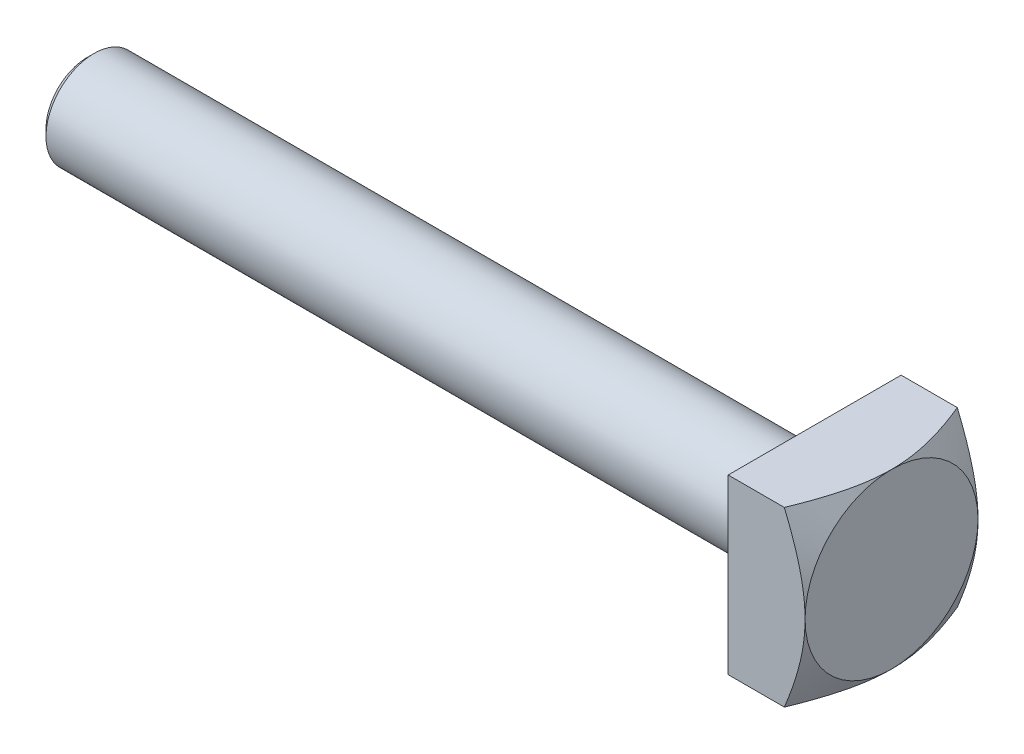
ISO-10303-21;
HEADER;
FILE_DESCRIPTION(('STEP AP214'),'2;1');
FILE_NAME('part.step','',(''),(''),'','','');
FILE_SCHEMA(('AUTOMOTIVE_DESIGN { 1 0 10303 214 1 1 1 1 }'));
ENDSEC;
DATA;
#1=APPLICATION_CONTEXT('core data for automotive mechanical design processes');
#2=APPLICATION_PROTOCOL_DEFINITION('international standard','automotive_design',2000,#1);
#3=PRODUCT_CONTEXT('',#1,'mechanical');
#4=PRODUCT('Part','Part','',(#3));
#5=PRODUCT_RELATED_PRODUCT_CATEGORY('part','',(#4));
#6=PRODUCT_DEFINITION_FORMATION('','',#4);
#7=PRODUCT_DEFINITION_CONTEXT('part definition',#1,'design');
#8=PRODUCT_DEFINITION('design','',#6,#7);
#9=PRODUCT_DEFINITION_SHAPE('','',#8);
#10=(LENGTH_UNIT() NAMED_UNIT(*) SI_UNIT(.MILLI.,.METRE.));
#11=(NAMED_UNIT(*) PLANE_ANGLE_UNIT() SI_UNIT($,.RADIAN.));
#12=(NAMED_UNIT(*) SI_UNIT($,.STERADIAN.) SOLID_ANGLE_UNIT());
#13=UNCERTAINTY_MEASURE_WITH_UNIT(LENGTH_MEASURE(1.E-05),#10,'distance_accuracy_value','');
#14=(GEOMETRIC_REPRESENTATION_CONTEXT(3) GLOBAL_UNCERTAINTY_ASSIGNED_CONTEXT((#13)) GLOBAL_UNIT_ASSIGNED_CONTEXT((#10,
#11,#12)) REPRESENTATION_CONTEXT('',''));
#15=CARTESIAN_POINT('',(0.,0.,0.));
#16=DIRECTION('',(0.,0.,1.));
#17=DIRECTION('',(1.,0.,0.));
#18=AXIS2_PLACEMENT_3D('',#15,#16,#17);
#19=CARTESIAN_POINT('',(49.3325100261348,9.,-9.));
#20=DIRECTION('',(0.,0.,1.));
#21=DIRECTION('',(0.,-1.,0.));
#22=AXIS2_PLACEMENT_3D('',#19,#20,#21);
#23=PLANE('',#22);
#24=CARTESIAN_POINT('',(42.8571264990048,-18.1017748932251,-9.));
#25=CARTESIAN_POINT('',(43.0848290014647,-17.6612589377098,-9.));
#26=CARTESIAN_POINT('',(43.3112860429918,-17.2200930246903,-9.));
#27=CARTESIAN_POINT('',(43.7610460759945,-16.3361243206803,-9.));
#28=CARTESIAN_POINT('',(43.9843488789998,-15.893321433856,-9.));
#29=CARTESIAN_POINT('',(44.4275990724742,-15.0048139056271,-9.));
#30=CARTESIAN_POINT('',(44.6475379613083,-14.5591050150091,-9.));
#31=CARTESIAN_POINT('',(45.0826038939738,-13.6653526957074,-9.));
#32=CARTESIAN_POINT('',(45.2977310422765,-13.2173093179705,-9.));
#33=CARTESIAN_POINT('',(45.7339460114688,-12.2929271397109,-9.));
#34=CARTESIAN_POINT('',(45.9546822234214,-11.8164219208137,-9.));
#35=CARTESIAN_POINT('',(46.3874426773042,-10.8594183684812,-9.));
#36=CARTESIAN_POINT('',(46.5994663826154,-10.3789197912727,-9.));
#37=CARTESIAN_POINT('',(47.0118693140859,-9.41339556488041,-9.));
#38=CARTESIAN_POINT('',(47.2122579538238,-8.92837395459212,-9.));
#39=CARTESIAN_POINT('',(47.5977586152819,-7.95230683121941,-9.));
#40=CARTESIAN_POINT('',(47.782872961797,-7.46126224796708,-9.));
#41=CARTESIAN_POINT('',(48.0440952998417,-6.72205623629925,-9.));
#42=CARTESIAN_POINT('',(48.1279877465829,-6.47664584233824,-9.));
#43=CARTESIAN_POINT('',(48.2899112549478,-5.98390233794157,-9.));
#44=CARTESIAN_POINT('',(48.3679423425386,-5.7365692360293,-9.));
#45=CARTESIAN_POINT('',(48.5919234373371,-4.99146980810668,-9.));
#46=CARTESIAN_POINT('',(48.7277667272913,-4.49058825682384,-9.));
#47=CARTESIAN_POINT('',(48.9615567599171,-3.49029425867013,-9.));
#48=CARTESIAN_POINT('',(49.0602031345005,-2.99105052515099,-9.));
#49=CARTESIAN_POINT('',(49.1761930199103,-2.23731632818205,-9.));
#50=CARTESIAN_POINT('',(49.2095268563288,-1.9852530110465,-9.));
#51=CARTESIAN_POINT('',(49.2646801673453,-1.47988072595095,-9.));
#52=CARTESIAN_POINT('',(49.2865008184612,-1.22657188794033,-9.));
#53=CARTESIAN_POINT('',(49.3215491863488,-0.661621376465719,-9.));
#54=CARTESIAN_POINT('',(49.3317045942102,-0.349782683998991,-9.));
#55=CARTESIAN_POINT('',(49.3332232252704,0.273946712163919,-9.));
#56=CARTESIAN_POINT('',(49.3245857611839,0.585837417345174,-9.));
#57=CARTESIAN_POINT('',(49.2889201862553,1.20861594829024,-9.));
#58=CARTESIAN_POINT('',(49.2618883258218,1.51950355659402,-9.));
#59=CARTESIAN_POINT('',(49.1906150441582,2.13928297825901,-9.));
#60=CARTESIAN_POINT('',(49.1463730476391,2.44817472455294,-9.));
#61=CARTESIAN_POINT('',(49.0409293862979,3.07199163964561,-9.));
#62=CARTESIAN_POINT('',(48.9792843562127,3.38684108287753,-9.));
#63=CARTESIAN_POINT('',(48.8417401677814,4.01338447228308,-9.));
#64=CARTESIAN_POINT('',(48.7658406400166,4.32507833645622,-9.));
#65=CARTESIAN_POINT('',(48.6018632193055,4.94539738591791,-9.));
#66=CARTESIAN_POINT('',(48.5137790599304,5.25402090404895,-9.));
#67=CARTESIAN_POINT('',(48.3740006498793,5.71459738376124,-9.));
#68=CARTESIAN_POINT('',(48.3261331737932,5.86772771850972,-9.));
#69=CARTESIAN_POINT('',(48.228060525201,6.17323857639417,-9.));
#70=CARTESIAN_POINT('',(48.1778553539461,6.32561909993144,-9.));
#71=CARTESIAN_POINT('',(48.0336207759508,6.75327955916404,-9.));
#72=CARTESIAN_POINT('',(47.9371522959459,7.02773820362801,-9.));
#73=CARTESIAN_POINT('',(47.7382764571364,7.5745024899511,-9.));
#74=CARTESIAN_POINT('',(47.635868739271,7.84680800050774,-9.));
#75=CARTESIAN_POINT('',(47.4259979322936,8.38952634357004,-9.));
#76=CARTESIAN_POINT('',(47.3185337697091,8.65993876005014,-9.));
#77=CARTESIAN_POINT('',(47.0993180334821,9.1990230644776,-9.));
#78=CARTESIAN_POINT('',(46.9875663470345,9.46769490641265,-9.));
#79=CARTESIAN_POINT('',(46.6466464450032,10.2718794378225,-9.));
#80=CARTESIAN_POINT('',(46.4120049359439,10.8050727688798,-9.));
#81=CARTESIAN_POINT('',(45.9320394137551,11.8665226777474,-9.));
#82=CARTESIAN_POINT('',(45.6867165417881,12.3947797756403,-9.));
#83=CARTESIAN_POINT('',(45.1872036037991,13.4491484430963,-9.));
#84=CARTESIAN_POINT('',(44.9329876443729,13.9752477145128,-9.));
#85=CARTESIAN_POINT('',(44.4183349749992,15.0244001691293,-9.));
#86=CARTESIAN_POINT('',(44.157898129916,15.5474532858505,-9.));
#87=CARTESIAN_POINT('',(43.6323200467052,16.5908336156542,-9.));
#88=CARTESIAN_POINT('',(43.3671814160637,17.1111621443734,-9.));
#89=CARTESIAN_POINT('',(42.8330653729605,18.149836976446,-9.));
#90=CARTESIAN_POINT('',(42.5640879911795,18.6681832956,-8.99999999999999));
#91=CARTESIAN_POINT('',(41.8255485481526,20.0811503383153,-8.99999999999999));
#92=CARTESIAN_POINT('',(41.3529251789218,20.9741702349986,-8.99999999999999));
#93=CARTESIAN_POINT('',(40.4011346006905,22.7568811836065,-8.99999999999999));
#94=CARTESIAN_POINT('',(39.9219664042756,23.6465717068492,-8.99999999999999));
#95=CARTESIAN_POINT('',(38.9620672069348,25.4174938178518,-8.99999999999999));
#96=CARTESIAN_POINT('',(38.4813675560373,26.2987424115097,-8.99999999999999));
#97=CARTESIAN_POINT('',(37.7577081518417,27.6190826148847,-8.99999999999999));
#98=CARTESIAN_POINT('',(37.5160745934232,28.0589021981923,-8.99999999999999));
#99=CARTESIAN_POINT('',(37.0320269665231,28.938110759695,-8.99999999999999));
#100=CARTESIAN_POINT('',(36.7896128993166,29.3774997385919,-8.99999999999999));
#101=CARTESIAN_POINT('',(36.5468597869242,29.8167013755112,-8.99999999999999));
#102=B_SPLINE_CURVE_WITH_KNOTS('',3,(#24,#25,#26,#27,#28,#29,#30,#31,#32,#33,#34,#35,#36,#37,
#38,#39,#40,#41,#42,#43,#44,#45,#46,#47,#48,#49,#50,#51,#52,#53,#54,#55,#56,#57,#58,#59,#60,#61,
#62,#63,#64,#65,#66,#67,#68,#69,#70,#71,#72,#73,#74,#75,#76,#77,#78,#79,#80,#81,#82,#83,#84,#85,
#86,#87,#88,#89,#90,#91,#92,#93,#94,#95,#96,#97,#98,#99,#100,#101),.UNSPECIFIED.,.F.,.F.,(4,2,2,
2,2,2,2,2,2,2,2,2,2,2,2,2,2,2,2,2,2,2,2,2,2,2,2,2,2,2,2,2,2,2,2,2,2,2,4),(0.,1.48766363582432,
2.97541578887709,4.46645434609266,5.95746049873591,7.53284221712307,9.10832082110335,
10.6825064628679,12.2564520650098,13.0344472240505,13.8124389361993,15.3683742473705,
16.8933806396812,17.6559266959657,18.418394813519,19.3538325720914,20.2893045416898,
21.2249672589862,22.1606612556801,23.1227603009219,24.0848842833078,25.0475049284993,
25.5288024194435,26.0100996527724,26.8827674953854,27.7554881508663,28.6283949265052,
29.5013246841486,31.2487573650983,32.9960038118538,34.7488487487578,36.5017317972244,
38.2536713934606,40.0055969953789,43.0366786505794,46.0682227686008,49.0796961462,
50.5851697239116,52.0906408435993),.UNSPECIFIED.);
#103=CARTESIAN_POINT('',(47.1801932204919,-9.,-9.));
#104=VERTEX_POINT('',#103);
#105=CARTESIAN_POINT('',(49.3325100261348,0.,-9.));
#106=VERTEX_POINT('',#105);
#107=EDGE_CURVE('E205',#104,#106,#102,.T.);
#108=ORIENTED_EDGE('',*,*,#107,.F.);
#109=DIRECTION('',(-1.,0.,0.));
#110=VECTOR('',#109,1.);
#111=CARTESIAN_POINT('',(49.3325100261348,-9.,-9.));
#112=LINE('',#111,#110);
#113=CARTESIAN_POINT('',(41.3325100261348,-9.,-9.));
#114=VERTEX_POINT('',#113);
#115=EDGE_CURVE('E194',#104,#114,#112,.T.);
#116=ORIENTED_EDGE('',*,*,#115,.T.);
#117=DIRECTION('',(0.,1.,0.));
#118=VECTOR('',#117,1.);
#119=CARTESIAN_POINT('',(41.3325100261348,9.,-9.));
#120=LINE('',#119,#118);
#121=CARTESIAN_POINT('',(41.3325100261348,9.,-9.));
#122=VERTEX_POINT('',#121);
#123=EDGE_CURVE('E203',#114,#122,#120,.T.);
#124=ORIENTED_EDGE('',*,*,#123,.T.);
#125=DIRECTION('',(-1.,0.,0.));
#126=VECTOR('',#125,1.);
#127=CARTESIAN_POINT('',(49.3325100261348,9.,-9.));
#128=LINE('',#127,#126);
#129=CARTESIAN_POINT('',(47.180193220492,9.,-8.99999999999999));
#130=VERTEX_POINT('',#129);
#131=EDGE_CURVE('E184',#130,#122,#128,.T.);
#132=ORIENTED_EDGE('',*,*,#131,.F.);
#133=EDGE_CURVE('E94',#106,#130,#102,.T.);
#134=ORIENTED_EDGE('',*,*,#133,.F.);
#135=EDGE_LOOP('',(#108,#116,#124,#132,#134));
#136=FACE_BOUND('',#135,.T.);
#137=ADVANCED_FACE('F38',(#136),#23,.F.);
#138=CARTESIAN_POINT('',(49.3325100261348,9.,9.));
#139=DIRECTION('',(0.,-1.,0.));
#140=DIRECTION('',(1.,0.,0.));
#141=AXIS2_PLACEMENT_3D('',#138,#139,#140);
#142=PLANE('',#141);
#143=CARTESIAN_POINT('',(42.8571265009112,9.,-18.1017748895375));
#144=CARTESIAN_POINT('',(43.0848290032961,9.,-17.6612589341495));
#145=CARTESIAN_POINT('',(43.3112860447483,9.,-17.2200930212575));
#146=CARTESIAN_POINT('',(43.7610460776014,9.,-16.3361243175025));
#147=CARTESIAN_POINT('',(43.984348880532,9.,-15.8933214308058));
#148=CARTESIAN_POINT('',(44.4275990738574,9.,-15.0048139028331));
#149=CARTESIAN_POINT('',(44.6475379626171,9.,-14.5591050123436));
#150=CARTESIAN_POINT('',(45.0826038951346,9.,-13.6653526932995));
#151=CARTESIAN_POINT('',(45.2977310433637,9.,-13.2173093156917));
#152=CARTESIAN_POINT('',(45.7339460124,9.,-12.292927137711));
#153=CARTESIAN_POINT('',(45.9546822242704,9.,-11.8164219189638));
#154=CARTESIAN_POINT('',(46.3874426779917,9.,-10.859418366933));
#155=CARTESIAN_POINT('',(46.5994663832237,9.,-10.378919789876));
#156=CARTESIAN_POINT('',(47.0118693145404,9.,-9.41339556378903));
#157=CARTESIAN_POINT('',(47.2122579542037,9.,-8.92837395365442));
#158=CARTESIAN_POINT('',(47.59775861552,9.,-7.95230683059232));
#159=CARTESIAN_POINT('',(47.7828729619681,9.,-7.46126224749691));
#160=CARTESIAN_POINT('',(48.0440952999135,9.,-6.72205623608937));
#161=CARTESIAN_POINT('',(48.1279877466184,9.,-6.47664584223019));
#162=CARTESIAN_POINT('',(48.2899112549158,9.,-5.98390233803879));
#163=CARTESIAN_POINT('',(48.3679423424753,9.,-5.73656923622994));
#164=CARTESIAN_POINT('',(48.5919234371887,9.,-4.99146980862027));
#165=CARTESIAN_POINT('',(48.7277667270982,9.,-4.49058825754963));
#166=CARTESIAN_POINT('',(48.9615567596714,9.,-3.49029425981931));
#167=CARTESIAN_POINT('',(49.0602031342458,9.,-2.99105052651115));
#168=CARTESIAN_POINT('',(49.1761930196747,9.,-2.23731632986047));
#169=CARTESIAN_POINT('',(49.209526856105,9.,-1.98525301283123));
#170=CARTESIAN_POINT('',(49.2646801671563,9.,-1.47988072794818));
#171=CARTESIAN_POINT('',(49.2865008182954,9.,-1.22657189004375));
#172=CARTESIAN_POINT('',(49.3215491862619,9.,-0.661621378563955));
#173=CARTESIAN_POINT('',(49.3317045941679,9.,-0.349782685984671));
#174=CARTESIAN_POINT('',(49.3332232253036,9.,0.273946710405681));
#175=CARTESIAN_POINT('',(49.324585761248,9.,0.585837415701822));
#176=CARTESIAN_POINT('',(49.2889201863663,9.,1.20861594687753));
#177=CARTESIAN_POINT('',(49.2618883259489,9.,1.51950355529706));
#178=CARTESIAN_POINT('',(49.1906150443029,9.,2.1392829771931));
#179=CARTESIAN_POINT('',(49.1463730477854,9.,2.44817472360233));
#180=CARTESIAN_POINT('',(49.0409293864338,9.,3.07199163892937));
#181=CARTESIAN_POINT('',(48.9792843563362,9.,3.38684108228029));
#182=CARTESIAN_POINT('',(48.8417401678683,9.,4.01338447192159));
#183=CARTESIAN_POINT('',(48.7658406400794,9.,4.32507833621148));
#184=CARTESIAN_POINT('',(48.6018632193108,9.,4.94539738590476));
#185=CARTESIAN_POINT('',(48.5137790599021,9.,5.25402090415064));
#186=CARTESIAN_POINT('',(48.3740006497954,9.,5.71459738403346));
#187=CARTESIAN_POINT('',(48.3261331736899,9.,5.86772771883849));
#188=CARTESIAN_POINT('',(48.2280605250571,9.,6.17323857683552));
#189=CARTESIAN_POINT('',(48.1778553537812,9.,6.32561910042881));
#190=CARTESIAN_POINT('',(48.0336207757631,9.,6.7532795597048));
#191=CARTESIAN_POINT('',(47.9371522957579,9.,7.02773820415654));
#192=CARTESIAN_POINT('',(47.7382764569487,9.,7.57450249045549));
#193=CARTESIAN_POINT('',(47.635868739084,9.,7.8468080010002));
#194=CARTESIAN_POINT('',(47.4259979321088,9.,8.38952634403891));
#195=CARTESIAN_POINT('',(47.3185337695259,9.,8.65993876050735));
#196=CARTESIAN_POINT('',(47.0993180333028,9.,9.19902306491171));
#197=CARTESIAN_POINT('',(46.9875663468575,9.,9.46769490683534));
#198=CARTESIAN_POINT('',(46.6466464448341,9.,10.2718794382111));
#199=CARTESIAN_POINT('',(46.4120049357812,9.,10.805072769246));
#200=CARTESIAN_POINT('',(45.9320394136067,9.,11.8665226780694));
#201=CARTESIAN_POINT('',(45.6867165416476,9.,12.3947797759406));
#202=CARTESIAN_POINT('',(45.187203603676,9.,13.4491484433524));
#203=CARTESIAN_POINT('',(44.9329876442593,9.,13.9752477147464));
#204=CARTESIAN_POINT('',(44.4183349749054,9.,15.0244001693183));
#205=CARTESIAN_POINT('',(44.1578981298326,9.,15.5474532860173));
#206=CARTESIAN_POINT('',(43.6323200466427,9.,16.5908336157771));
#207=CARTESIAN_POINT('',(43.3671814160119,9.,17.1111621444745));
#208=CARTESIAN_POINT('',(42.8330653729305,9.,18.1498369765037));
#209=CARTESIAN_POINT('',(42.5640879911607,9.,18.6681832956361));
#210=CARTESIAN_POINT('',(41.825548548165,9.,20.0811503382915));
#211=CARTESIAN_POINT('',(41.3529251789544,9.,20.9741702349368));
#212=CARTESIAN_POINT('',(40.4011346007645,9.,22.7568811834687));
#213=CARTESIAN_POINT('',(39.9219664043703,9.,23.6465717066735));
#214=CARTESIAN_POINT('',(38.9620672070701,9.,25.4174938176032));
#215=CARTESIAN_POINT('',(38.4813675561922,9.,26.298742411226));
#216=CARTESIAN_POINT('',(37.7577081520262,9.,27.6190826145486));
#217=CARTESIAN_POINT('',(37.5160745936175,9.,28.0589021978388));
#218=CARTESIAN_POINT('',(37.0320269667372,9.,28.9381107593066));
#219=CARTESIAN_POINT('',(36.7896128995406,9.,29.3774997381861));
#220=CARTESIAN_POINT('',(36.5468597871582,9.,29.8167013750879));
#221=B_SPLINE_CURVE_WITH_KNOTS('',3,(#143,#144,#145,#146,#147,#148,#149,#150,#151,#152,#153,
#154,#155,#156,#157,#158,#159,#160,#161,#162,#163,#164,#165,#166,#167,#168,#169,#170,#171,#172,
#173,#174,#175,#176,#177,#178,#179,#180,#181,#182,#183,#184,#185,#186,#187,#188,#189,#190,#191,
#192,#193,#194,#195,#196,#197,#198,#199,#200,#201,#202,#203,#204,#205,#206,#207,#208,#209,#210,
#211,#212,#213,#214,#215,#216,#217,#218,#219,#220),.UNSPECIFIED.,.F.,.F.,(4,2,2,2,2,2,2,2,2,2,2,
2,2,2,2,2,2,2,2,2,2,2,2,2,2,2,2,2,2,2,2,2,2,2,2,2,2,2,4),(0.,1.48766363538162,2.97541578799165,
4.46645434476266,5.95746049696137,7.53284221483657,9.10832081830478,10.6825064595578,
12.2564520611885,13.0344472199051,13.8124389317298,15.3683742422529,16.8933806339401,
17.6559266899135,18.4183948071557,19.3538325660694,20.2893045360091,21.2249672536466,
22.1606612506816,23.1227602962805,24.0848842790234,25.0475049245735,25.5288024156972,
26.0100996492054,26.8827674917841,27.7554881472308,28.6283949228355,29.5013246804446,
31.2487573613252,32.9960038080116,34.7488487448424,36.5017317932358,38.2536713893991,
40.0055969912446,43.0366786463155,46.0682227642071,49.0796961416859,50.5851697193374,
52.0906408389649),.UNSPECIFIED.);
#222=CARTESIAN_POINT('',(49.3325100261348,9.,0.));
#223=VERTEX_POINT('',#222);
#224=EDGE_CURVE('E90',#130,#223,#221,.T.);
#225=ORIENTED_EDGE('',*,*,#224,.F.);
#226=ORIENTED_EDGE('',*,*,#131,.T.);
#227=DIRECTION('',(0.,0.,1.));
#228=VECTOR('',#227,1.);
#229=CARTESIAN_POINT('',(41.3325100261348,9.,9.));
#230=LINE('',#229,#228);
#231=CARTESIAN_POINT('',(41.3325100261348,9.,9.));
#232=VERTEX_POINT('',#231);
#233=EDGE_CURVE('E202',#122,#232,#230,.T.);
#234=ORIENTED_EDGE('',*,*,#233,.T.);
#235=DIRECTION('',(-1.,0.,0.));
#236=VECTOR('',#235,1.);
#237=CARTESIAN_POINT('',(49.3325100261348,9.,9.));
#238=LINE('',#237,#236);
#239=CARTESIAN_POINT('',(47.1801932204919,9.,9.));
#240=VERTEX_POINT('',#239);
#241=EDGE_CURVE('E111',#240,#232,#238,.T.);
#242=ORIENTED_EDGE('',*,*,#241,.F.);
#243=EDGE_CURVE('E98',#223,#240,#221,.T.);
#244=ORIENTED_EDGE('',*,*,#243,.F.);
#245=EDGE_LOOP('',(#225,#226,#234,#242,#244));
#246=FACE_BOUND('',#245,.T.);
#247=ADVANCED_FACE('F109',(#246),#142,.F.);
#248=CARTESIAN_POINT('',(49.3325100261348,9.,9.));
#249=DIRECTION('',(0.,0.,-1.));
#250=DIRECTION('',(-1.,0.,0.));
#251=AXIS2_PLACEMENT_3D('',#248,#249,#250);
#252=PLANE('',#251);
#253=CARTESIAN_POINT('',(42.8571265009112,-18.1017748895375,9.));
#254=CARTESIAN_POINT('',(43.0848290032961,-17.6612589341495,9.));
#255=CARTESIAN_POINT('',(43.3112860447482,-17.2200930212575,9.));
#256=CARTESIAN_POINT('',(43.7610460776014,-16.3361243175025,9.));
#257=CARTESIAN_POINT('',(43.984348880532,-15.8933214308058,9.));
#258=CARTESIAN_POINT('',(44.4275990738574,-15.0048139028331,9.));
#259=CARTESIAN_POINT('',(44.6475379626171,-14.5591050123436,9.));
#260=CARTESIAN_POINT('',(45.0826038951346,-13.6653526932995,9.));
#261=CARTESIAN_POINT('',(45.2977310433637,-13.2173093156917,9.));
#262=CARTESIAN_POINT('',(45.7339460124,-12.292927137711,9.));
#263=CARTESIAN_POINT('',(45.9546822242704,-11.8164219189638,9.));
#264=CARTESIAN_POINT('',(46.3874426779917,-10.859418366933,9.));
#265=CARTESIAN_POINT('',(46.5994663832237,-10.378919789876,9.));
#266=CARTESIAN_POINT('',(47.0118693145404,-9.41339556378903,9.));
#267=CARTESIAN_POINT('',(47.2122579542037,-8.92837395365442,9.));
#268=CARTESIAN_POINT('',(47.59775861552,-7.95230683059232,9.));
#269=CARTESIAN_POINT('',(47.7828729619681,-7.46126224749691,9.));
#270=CARTESIAN_POINT('',(48.0440952999135,-6.72205623608937,9.));
#271=CARTESIAN_POINT('',(48.1279877466184,-6.47664584223019,9.));
#272=CARTESIAN_POINT('',(48.2899112549158,-5.98390233803879,9.));
#273=CARTESIAN_POINT('',(48.3679423424753,-5.73656923622994,9.));
#274=CARTESIAN_POINT('',(48.5919234371887,-4.99146980862027,9.));
#275=CARTESIAN_POINT('',(48.7277667270982,-4.49058825754963,9.));
#276=CARTESIAN_POINT('',(48.9615567596714,-3.49029425981931,9.));
#277=CARTESIAN_POINT('',(49.0602031342458,-2.99105052651115,9.));
#278=CARTESIAN_POINT('',(49.1761930196747,-2.23731632986048,9.));
#279=CARTESIAN_POINT('',(49.209526856105,-1.98525301283123,9.));
#280=CARTESIAN_POINT('',(49.2646801671563,-1.47988072794818,9.));
#281=CARTESIAN_POINT('',(49.2865008182954,-1.22657189004375,9.));
#282=CARTESIAN_POINT('',(49.3215491862619,-0.661621378563957,9.));
#283=CARTESIAN_POINT('',(49.3317045941679,-0.349782685984673,9.));
#284=CARTESIAN_POINT('',(49.3332232253036,0.27394671040568,9.));
#285=CARTESIAN_POINT('',(49.324585761248,0.585837415701821,9.));
#286=CARTESIAN_POINT('',(49.2889201863663,1.20861594687753,9.));
#287=CARTESIAN_POINT('',(49.2618883259489,1.51950355529706,9.));
#288=CARTESIAN_POINT('',(49.1906150443029,2.1392829771931,9.));
#289=CARTESIAN_POINT('',(49.1463730477854,2.44817472360233,9.));
#290=CARTESIAN_POINT('',(49.0409293864338,3.07199163892937,9.));
#291=CARTESIAN_POINT('',(48.9792843563362,3.38684108228029,9.));
#292=CARTESIAN_POINT('',(48.8417401678683,4.01338447192159,9.));
#293=CARTESIAN_POINT('',(48.7658406400794,4.32507833621148,9.));
#294=CARTESIAN_POINT('',(48.6018632193108,4.94539738590476,9.));
#295=CARTESIAN_POINT('',(48.5137790599021,5.25402090415063,9.));
#296=CARTESIAN_POINT('',(48.3740006497954,5.71459738403345,9.));
#297=CARTESIAN_POINT('',(48.3261331736899,5.86772771883849,9.));
#298=CARTESIAN_POINT('',(48.2280605250571,6.17323857683551,9.));
#299=CARTESIAN_POINT('',(48.1778553537812,6.32561910042881,9.));
#300=CARTESIAN_POINT('',(48.0336207757631,6.75327955970481,9.));
#301=CARTESIAN_POINT('',(47.9371522957579,7.02773820415655,9.));
#302=CARTESIAN_POINT('',(47.7382764569487,7.57450249045549,9.));
#303=CARTESIAN_POINT('',(47.6358687390839,7.8468080010002,9.));
#304=CARTESIAN_POINT('',(47.4259979321088,8.38952634403891,9.));
#305=CARTESIAN_POINT('',(47.3185337695259,8.65993876050735,9.));
#306=CARTESIAN_POINT('',(47.0993180333028,9.19902306491171,9.));
#307=CARTESIAN_POINT('',(46.9875663468575,9.46769490683534,9.));
#308=CARTESIAN_POINT('',(46.6466464448341,10.2718794382111,9.));
#309=CARTESIAN_POINT('',(46.4120049357812,10.805072769246,9.));
#310=CARTESIAN_POINT('',(45.9320394136067,11.8665226780694,9.));
#311=CARTESIAN_POINT('',(45.6867165416476,12.3947797759406,9.));
#312=CARTESIAN_POINT('',(45.187203603676,13.4491484433524,9.));
#313=CARTESIAN_POINT('',(44.9329876442593,13.9752477147464,9.));
#314=CARTESIAN_POINT('',(44.4183349749054,15.0244001693183,9.));
#315=CARTESIAN_POINT('',(44.1578981298326,15.5474532860173,9.));
#316=CARTESIAN_POINT('',(43.6323200466427,16.5908336157771,9.));
#317=CARTESIAN_POINT('',(43.3671814160119,17.1111621444745,9.));
#318=CARTESIAN_POINT('',(42.8330653729305,18.1498369765037,9.));
#319=CARTESIAN_POINT('',(42.5640879911607,18.6681832956361,9.));
#320=CARTESIAN_POINT('',(41.825548548165,20.0811503382915,9.));
#321=CARTESIAN_POINT('',(41.3529251789544,20.9741702349368,9.));
#322=CARTESIAN_POINT('',(40.4011346007645,22.7568811834687,9.));
#323=CARTESIAN_POINT('',(39.9219664043703,23.6465717066735,9.));
#324=CARTESIAN_POINT('',(38.9620672070701,25.4174938176032,9.));
#325=CARTESIAN_POINT('',(38.4813675561922,26.298742411226,9.));
#326=CARTESIAN_POINT('',(37.7577081520262,27.6190826145486,9.));
#327=CARTESIAN_POINT('',(37.5160745936175,28.0589021978388,9.));
#328=CARTESIAN_POINT('',(37.0320269667372,28.9381107593066,9.));
#329=CARTESIAN_POINT('',(36.7896128995406,29.3774997381861,9.));
#330=CARTESIAN_POINT('',(36.5468597871582,29.8167013750879,9.));
#331=B_SPLINE_CURVE_WITH_KNOTS('',3,(#253,#254,#255,#256,#257,#258,#259,#260,#261,#262,#263,
#264,#265,#266,#267,#268,#269,#270,#271,#272,#273,#274,#275,#276,#277,#278,#279,#280,#281,#282,
#283,#284,#285,#286,#287,#288,#289,#290,#291,#292,#293,#294,#295,#296,#297,#298,#299,#300,#301,
#302,#303,#304,#305,#306,#307,#308,#309,#310,#311,#312,#313,#314,#315,#316,#317,#318,#319,#320,
#321,#322,#323,#324,#325,#326,#327,#328,#329,#330),.UNSPECIFIED.,.F.,.F.,(4,2,2,2,2,2,2,2,2,2,2,
2,2,2,2,2,2,2,2,2,2,2,2,2,2,2,2,2,2,2,2,2,2,2,2,2,2,2,4),(0.,1.48766363538162,2.97541578799166,
4.46645434476267,5.95746049696138,7.53284221483658,9.1083208183048,10.6825064595579,
12.2564520611885,13.0344472199051,13.8124389317298,15.3683742422529,16.8933806339401,
17.6559266899135,18.4183948071557,19.3538325660694,20.2893045360091,21.2249672536466,
22.1606612506817,23.1227602962805,24.0848842790234,25.0475049245735,25.5288024156972,
26.0100996492054,26.8827674917842,27.7554881472309,28.6283949228355,29.5013246804446,
31.2487573613252,32.9960038080116,34.7488487448424,36.5017317932358,38.2536713893992,
40.0055969912446,43.0366786463155,46.0682227642071,49.079696141686,50.5851697193374,
52.0906408389649),.UNSPECIFIED.);
#332=CARTESIAN_POINT('',(49.3325100261348,0.,9.));
#333=VERTEX_POINT('',#332);
#334=EDGE_CURVE('E103',#240,#333,#331,.F.);
#335=ORIENTED_EDGE('',*,*,#334,.F.);
#336=ORIENTED_EDGE('',*,*,#241,.T.);
#337=DIRECTION('',(0.,-1.,0.));
#338=VECTOR('',#337,1.);
#339=CARTESIAN_POINT('',(41.3325100261348,9.,9.));
#340=LINE('',#339,#338);
#341=CARTESIAN_POINT('',(41.3325100261348,-9.,9.));
#342=VERTEX_POINT('',#341);
#343=EDGE_CURVE('E199',#232,#342,#340,.T.);
#344=ORIENTED_EDGE('',*,*,#343,.T.);
#345=DIRECTION('',(-1.,0.,0.));
#346=VECTOR('',#345,1.);
#347=CARTESIAN_POINT('',(49.3325100261348,-9.,9.));
#348=LINE('',#347,#346);
#349=CARTESIAN_POINT('',(47.1801932204919,-9.,9.));
#350=VERTEX_POINT('',#349);
#351=EDGE_CURVE('E192',#350,#342,#348,.T.);
#352=ORIENTED_EDGE('',*,*,#351,.F.);
#353=EDGE_CURVE('E112',#333,#350,#331,.F.);
#354=ORIENTED_EDGE('',*,*,#353,.F.);
#355=EDGE_LOOP('',(#335,#336,#344,#352,#354));
#356=FACE_BOUND('',#355,.T.);
#357=ADVANCED_FACE('F150',(#356),#252,.F.);
#358=CARTESIAN_POINT('',(49.3325100261348,-9.,9.));
#359=DIRECTION('',(0.,1.,0.));
#360=DIRECTION('',(-1.,0.,0.));
#361=AXIS2_PLACEMENT_3D('',#358,#359,#360);
#362=PLANE('',#361);
#363=CARTESIAN_POINT('',(42.8571264990048,-9.,-18.1017748932251));
#364=CARTESIAN_POINT('',(43.0848290014647,-9.,-17.6612589377098));
#365=CARTESIAN_POINT('',(43.3112860429918,-9.,-17.2200930246903));
#366=CARTESIAN_POINT('',(43.7610460759945,-9.,-16.3361243206803));
#367=CARTESIAN_POINT('',(43.9843488789998,-9.,-15.893321433856));
#368=CARTESIAN_POINT('',(44.4275990724742,-9.,-15.0048139056271));
#369=CARTESIAN_POINT('',(44.6475379613083,-9.,-14.5591050150091));
#370=CARTESIAN_POINT('',(45.0826038939738,-9.,-13.6653526957074));
#371=CARTESIAN_POINT('',(45.2977310422765,-9.,-13.2173093179705));
#372=CARTESIAN_POINT('',(45.7339460114688,-9.,-12.2929271397109));
#373=CARTESIAN_POINT('',(45.9546822234214,-9.,-11.8164219208137));
#374=CARTESIAN_POINT('',(46.3874426773042,-9.,-10.8594183684812));
#375=CARTESIAN_POINT('',(46.5994663826154,-9.,-10.3789197912727));
#376=CARTESIAN_POINT('',(47.0118693140859,-9.,-9.41339556488041));
#377=CARTESIAN_POINT('',(47.2122579538238,-9.,-8.92837395459212));
#378=CARTESIAN_POINT('',(47.5977586152819,-9.,-7.95230683121941));
#379=CARTESIAN_POINT('',(47.782872961797,-9.,-7.46126224796707));
#380=CARTESIAN_POINT('',(48.0440952998417,-9.,-6.72205623629925));
#381=CARTESIAN_POINT('',(48.1279877465829,-9.,-6.47664584233823));
#382=CARTESIAN_POINT('',(48.2899112549478,-9.,-5.98390233794157));
#383=CARTESIAN_POINT('',(48.3679423425386,-9.,-5.73656923602929));
#384=CARTESIAN_POINT('',(48.5919234373371,-9.,-4.99146980810668));
#385=CARTESIAN_POINT('',(48.7277667272913,-9.,-4.49058825682383));
#386=CARTESIAN_POINT('',(48.9615567599171,-9.,-3.49029425867012));
#387=CARTESIAN_POINT('',(49.0602031345005,-9.,-2.99105052515099));
#388=CARTESIAN_POINT('',(49.1761930199103,-9.,-2.23731632818204));
#389=CARTESIAN_POINT('',(49.2095268563288,-9.,-1.98525301104649));
#390=CARTESIAN_POINT('',(49.2646801673453,-9.,-1.47988072595095));
#391=CARTESIAN_POINT('',(49.2865008184612,-9.,-1.22657188794033));
#392=CARTESIAN_POINT('',(49.3215491863488,-9.,-0.661621376465717));
#393=CARTESIAN_POINT('',(49.3317045942102,-9.,-0.349782683998989));
#394=CARTESIAN_POINT('',(49.3332232252704,-9.,0.273946712163919));
#395=CARTESIAN_POINT('',(49.3245857611839,-9.,0.585837417345174));
#396=CARTESIAN_POINT('',(49.2889201862553,-9.,1.20861594829024));
#397=CARTESIAN_POINT('',(49.2618883258218,-9.,1.51950355659402));
#398=CARTESIAN_POINT('',(49.1906150441582,-9.,2.139282978259));
#399=CARTESIAN_POINT('',(49.1463730476391,-9.,2.44817472455293));
#400=CARTESIAN_POINT('',(49.0409293862979,-9.,3.07199163964561));
#401=CARTESIAN_POINT('',(48.9792843562127,-9.,3.38684108287753));
#402=CARTESIAN_POINT('',(48.8417401677813,-9.,4.01338447228307));
#403=CARTESIAN_POINT('',(48.7658406400166,-9.,4.32507833645622));
#404=CARTESIAN_POINT('',(48.6018632193055,-9.,4.94539738591791));
#405=CARTESIAN_POINT('',(48.5137790599304,-9.,5.25402090404894));
#406=CARTESIAN_POINT('',(48.3740006498793,-9.,5.71459738376124));
#407=CARTESIAN_POINT('',(48.3261331737932,-9.,5.86772771850972));
#408=CARTESIAN_POINT('',(48.228060525201,-9.,6.17323857639417));
#409=CARTESIAN_POINT('',(48.177855353946,-9.,6.32561909993144));
#410=CARTESIAN_POINT('',(48.0336207759508,-9.,6.75327955916404));
#411=CARTESIAN_POINT('',(47.9371522959459,-9.,7.02773820362801));
#412=CARTESIAN_POINT('',(47.7382764571364,-9.,7.5745024899511));
#413=CARTESIAN_POINT('',(47.635868739271,-9.,7.84680800050774));
#414=CARTESIAN_POINT('',(47.4259979322936,-9.,8.38952634357004));
#415=CARTESIAN_POINT('',(47.3185337697091,-9.,8.65993876005015));
#416=CARTESIAN_POINT('',(47.0993180334821,-9.,9.1990230644776));
#417=CARTESIAN_POINT('',(46.9875663470345,-9.,9.46769490641265));
#418=CARTESIAN_POINT('',(46.6466464450032,-9.,10.2718794378225));
#419=CARTESIAN_POINT('',(46.4120049359439,-9.,10.8050727688798));
#420=CARTESIAN_POINT('',(45.9320394137551,-9.,11.8665226777474));
#421=CARTESIAN_POINT('',(45.6867165417881,-9.,12.3947797756403));
#422=CARTESIAN_POINT('',(45.1872036037991,-9.,13.4491484430963));
#423=CARTESIAN_POINT('',(44.9329876443729,-9.,13.9752477145128));
#424=CARTESIAN_POINT('',(44.4183349749992,-9.,15.0244001691294));
#425=CARTESIAN_POINT('',(44.157898129916,-9.,15.5474532858505));
#426=CARTESIAN_POINT('',(43.6323200467052,-9.,16.5908336156543));
#427=CARTESIAN_POINT('',(43.3671814160637,-9.,17.1111621443734));
#428=CARTESIAN_POINT('',(42.8330653729604,-9.,18.149836976446));
#429=CARTESIAN_POINT('',(42.5640879911795,-9.,18.6681832956));
#430=CARTESIAN_POINT('',(41.8255485481526,-9.,20.0811503383153));
#431=CARTESIAN_POINT('',(41.3529251789217,-9.,20.9741702349986));
#432=CARTESIAN_POINT('',(40.4011346006905,-9.,22.7568811836065));
#433=CARTESIAN_POINT('',(39.9219664042755,-9.,23.6465717068493));
#434=CARTESIAN_POINT('',(38.9620672069348,-9.,25.4174938178519));
#435=CARTESIAN_POINT('',(38.4813675560373,-9.,26.2987424115097));
#436=CARTESIAN_POINT('',(37.7577081518417,-9.,27.6190826148847));
#437=CARTESIAN_POINT('',(37.5160745934231,-9.,28.0589021981924));
#438=CARTESIAN_POINT('',(37.0320269665231,-9.,28.938110759695));
#439=CARTESIAN_POINT('',(36.7896128993166,-9.,29.3774997385919));
#440=CARTESIAN_POINT('',(36.5468597869242,-9.,29.8167013755112));
#441=B_SPLINE_CURVE_WITH_KNOTS('',3,(#363,#364,#365,#366,#367,#368,#369,#370,#371,#372,#373,
#374,#375,#376,#377,#378,#379,#380,#381,#382,#383,#384,#385,#386,#387,#388,#389,#390,#391,#392,
#393,#394,#395,#396,#397,#398,#399,#400,#401,#402,#403,#404,#405,#406,#407,#408,#409,#410,#411,
#412,#413,#414,#415,#416,#417,#418,#419,#420,#421,#422,#423,#424,#425,#426,#427,#428,#429,#430,
#431,#432,#433,#434,#435,#436,#437,#438,#439,#440),.UNSPECIFIED.,.F.,.F.,(4,2,2,2,2,2,2,2,2,2,2,
2,2,2,2,2,2,2,2,2,2,2,2,2,2,2,2,2,2,2,2,2,2,2,2,2,2,2,4),(0.,1.48766363582433,2.97541578887709,
4.46645434609265,5.9574604987359,7.53284221712307,9.10832082110335,10.6825064628679,
12.2564520650098,13.0344472240505,13.8124389361993,15.3683742473705,16.8933806396812,
17.6559266959657,18.418394813519,19.3538325720914,20.2893045416898,21.2249672589862,
22.1606612556801,23.1227603009219,24.0848842833078,25.0475049284993,25.5288024194435,
26.0100996527724,26.8827674953854,27.7554881508663,28.6283949265052,29.5013246841486,
31.2487573650983,32.9960038118538,34.7488487487578,36.5017317972244,38.2536713934606,
40.0055969953789,43.0366786505794,46.0682227686008,49.0796961462,50.5851697239116,
52.0906408435993),.UNSPECIFIED.);
#442=CARTESIAN_POINT('',(49.3325100261348,-9.,0.));
#443=VERTEX_POINT('',#442);
#444=EDGE_CURVE('E146',#350,#443,#441,.F.);
#445=ORIENTED_EDGE('',*,*,#444,.F.);
#446=ORIENTED_EDGE('',*,*,#351,.T.);
#447=DIRECTION('',(0.,0.,-1.));
#448=VECTOR('',#447,1.);
#449=CARTESIAN_POINT('',(41.3325100261348,-9.,9.));
#450=LINE('',#449,#448);
#451=EDGE_CURVE('E196',#342,#114,#450,.T.);
#452=ORIENTED_EDGE('',*,*,#451,.T.);
#453=ORIENTED_EDGE('',*,*,#115,.F.);
#454=EDGE_CURVE('E106',#443,#104,#441,.F.);
#455=ORIENTED_EDGE('',*,*,#454,.F.);
#456=EDGE_LOOP('',(#445,#446,#452,#453,#455));
#457=FACE_BOUND('',#456,.T.);
#458=ADVANCED_FACE('F147',(#457),#362,.F.);
#459=CARTESIAN_POINT('',(-34.3745967550517,4.29289321881344,0.));
#460=DIRECTION('',(1.,0.,0.));
#461=DIRECTION('',(0.,1.,0.));
#462=AXIS2_PLACEMENT_3D('',#459,#460,#461);
#463=PLANE('',#462);
#464=CARTESIAN_POINT('',(-34.3745967550517,0.,0.));
#465=DIRECTION('',(-1.,0.,0.));
#466=DIRECTION('',(0.,-1.,0.));
#467=AXIS2_PLACEMENT_3D('',#464,#465,#466);
#468=CIRCLE('',#467,4.29289321881344);
#469=CARTESIAN_POINT('',(-34.3745967550517,-4.29289321881344,0.));
#470=VERTEX_POINT('',#469);
#471=EDGE_CURVE('E183',#470,#470,#468,.T.);
#472=ORIENTED_EDGE('',*,*,#471,.T.);
#473=EDGE_LOOP('',(#472));
#474=FACE_BOUND('',#473,.T.);
#475=ADVANCED_FACE('F40',(#474),#463,.F.);
#476=CARTESIAN_POINT('',(-59.9733513767945,0.,0.));
#477=DIRECTION('',(-1.,0.,0.));
#478=DIRECTION('',(0.,-1.,0.));
#479=AXIS2_PLACEMENT_3D('',#476,#477,#478);
#480=CYLINDRICAL_SURFACE('',#479,5.);
#481=CARTESIAN_POINT('',(-33.6674899738652,0.,0.));
#482=DIRECTION('',(-1.,0.,0.));
#483=DIRECTION('',(0.,-1.,0.));
#484=AXIS2_PLACEMENT_3D('',#481,#482,#483);
#485=CIRCLE('',#484,5.);
#486=CARTESIAN_POINT('',(-33.6674899738652,-5.,0.));
#487=VERTEX_POINT('',#486);
#488=EDGE_CURVE('E178',#487,#487,#485,.T.);
#489=ORIENTED_EDGE('',*,*,#488,.F.);
#490=EDGE_LOOP('',(#489));
#491=FACE_BOUND('',#490,.T.);
#492=CARTESIAN_POINT('',(41.3325100261348,0.,0.));
#493=DIRECTION('',(1.,0.,0.));
#494=DIRECTION('',(0.,0.,-1.));
#495=AXIS2_PLACEMENT_3D('',#492,#493,#494);
#496=CIRCLE('',#495,5.);
#497=CARTESIAN_POINT('',(41.3325100261348,0.,-5.));
#498=VERTEX_POINT('',#497);
#499=EDGE_CURVE('E181',#498,#498,#496,.T.);
#500=ORIENTED_EDGE('',*,*,#499,.F.);
#501=EDGE_LOOP('',(#500));
#502=FACE_BOUND('',#501,.T.);
#503=ADVANCED_FACE('F167',(#491,#502),#480,.T.);
#504=CARTESIAN_POINT('',(-33.6674899738652,0.,0.));
#505=DIRECTION('',(1.,0.,0.));
#506=DIRECTION('',(0.,1.,0.));
#507=AXIS2_PLACEMENT_3D('',#504,#505,#506);
#508=CONICAL_SURFACE('',#507,5.,0.785398163397462);
#509=ORIENTED_EDGE('',*,*,#471,.F.);
#510=EDGE_LOOP('',(#509));
#511=FACE_BOUND('',#510,.T.);
#512=ORIENTED_EDGE('',*,*,#488,.T.);
#513=EDGE_LOOP('',(#512));
#514=FACE_BOUND('',#513,.T.);
#515=ADVANCED_FACE('F165',(#511,#514),#508,.T.);
#516=CARTESIAN_POINT('',(41.3325100261348,0.,0.));
#517=DIRECTION('',(1.,0.,0.));
#518=DIRECTION('',(0.,0.,-1.));
#519=AXIS2_PLACEMENT_3D('',#516,#517,#518);
#520=PLANE('',#519);
#521=ORIENTED_EDGE('',*,*,#123,.F.);
#522=ORIENTED_EDGE('',*,*,#451,.F.);
#523=ORIENTED_EDGE('',*,*,#343,.F.);
#524=ORIENTED_EDGE('',*,*,#233,.F.);
#525=EDGE_LOOP('',(#521,#522,#523,#524));
#526=FACE_BOUND('',#525,.T.);
#527=ORIENTED_EDGE('',*,*,#499,.T.);
#528=EDGE_LOOP('',(#527));
#529=FACE_BOUND('',#528,.T.);
#530=ADVANCED_FACE('F136',(#526,#529),#520,.F.);
#531=CARTESIAN_POINT('',(49.3325100261348,0.,0.));
#532=DIRECTION('',(-1.,0.,0.));
#533=DIRECTION('',(0.,0.,-1.));
#534=AXIS2_PLACEMENT_3D('',#531,#532,#533);
#535=CONICAL_SURFACE('',#534,9.,1.0471975511966);
#536=ORIENTED_EDGE('',*,*,#107,.T.);
#537=CARTESIAN_POINT('',(49.3325100261348,0.,0.));
#538=DIRECTION('',(1.,0.,0.));
#539=DIRECTION('',(0.,0.,-1.));
#540=AXIS2_PLACEMENT_3D('',#537,#538,#539);
#541=CIRCLE('',#540,9.);
#542=EDGE_CURVE('E42',#443,#106,#541,.T.);
#543=ORIENTED_EDGE('',*,*,#542,.F.);
#544=ORIENTED_EDGE('',*,*,#454,.T.);
#545=EDGE_LOOP('',(#536,#543,#544));
#546=FACE_BOUND('',#545,.T.);
#547=ADVANCED_FACE('F131',(#546),#535,.T.);
#548=ORIENTED_EDGE('',*,*,#353,.T.);
#549=ORIENTED_EDGE('',*,*,#444,.T.);
#550=EDGE_CURVE('E47',#333,#443,#541,.T.);
#551=ORIENTED_EDGE('',*,*,#550,.F.);
#552=EDGE_LOOP('',(#548,#549,#551));
#553=FACE_BOUND('',#552,.T.);
#554=ADVANCED_FACE('F135',(#553),#535,.T.);
#555=ORIENTED_EDGE('',*,*,#243,.T.);
#556=ORIENTED_EDGE('',*,*,#334,.T.);
#557=EDGE_CURVE('E12',#223,#333,#541,.T.);
#558=ORIENTED_EDGE('',*,*,#557,.F.);
#559=EDGE_LOOP('',(#555,#556,#558));
#560=FACE_BOUND('',#559,.T.);
#561=ADVANCED_FACE('F101',(#560),#535,.T.);
#562=ORIENTED_EDGE('',*,*,#133,.T.);
#563=ORIENTED_EDGE('',*,*,#224,.T.);
#564=CARTESIAN_POINT('',(49.3325100261348,0.,0.));
#565=DIRECTION('',(1.,0.,0.));
#566=DIRECTION('',(0.,0.,-1.));
#567=AXIS2_PLACEMENT_3D('',#564,#565,#566);
#568=CIRCLE('',#567,9.);
#569=EDGE_CURVE('E54',#106,#223,#568,.T.);
#570=ORIENTED_EDGE('',*,*,#569,.F.);
#571=EDGE_LOOP('',(#562,#563,#570));
#572=FACE_BOUND('',#571,.T.);
#573=ADVANCED_FACE('F92',(#572),#535,.T.);
#574=CARTESIAN_POINT('',(49.3325100261348,0.,0.));
#575=DIRECTION('',(1.,0.,0.));
#576=DIRECTION('',(0.,0.,-1.));
#577=AXIS2_PLACEMENT_3D('',#574,#575,#576);
#578=PLANE('',#577);
#579=ORIENTED_EDGE('',*,*,#542,.T.);
#580=ORIENTED_EDGE('',*,*,#569,.T.);
#581=ORIENTED_EDGE('',*,*,#557,.T.);
#582=ORIENTED_EDGE('',*,*,#550,.T.);
#583=EDGE_LOOP('',(#579,#580,#581,#582));
#584=FACE_BOUND('',#583,.T.);
#585=ADVANCED_FACE('F105',(#584),#578,.T.);
#586=CLOSED_SHELL('',(#137,#247,#357,#458,#475,#503,#515,#530,#547,#554,#561,#573,#585));
#587=MANIFOLD_SOLID_BREP('B2',#586);
#588=ADVANCED_BREP_SHAPE_REPRESENTATION('',(#18,#587),#14);
#589=SHAPE_DEFINITION_REPRESENTATION(#9,#588);
ENDSEC;
END-ISO-10303-21;
